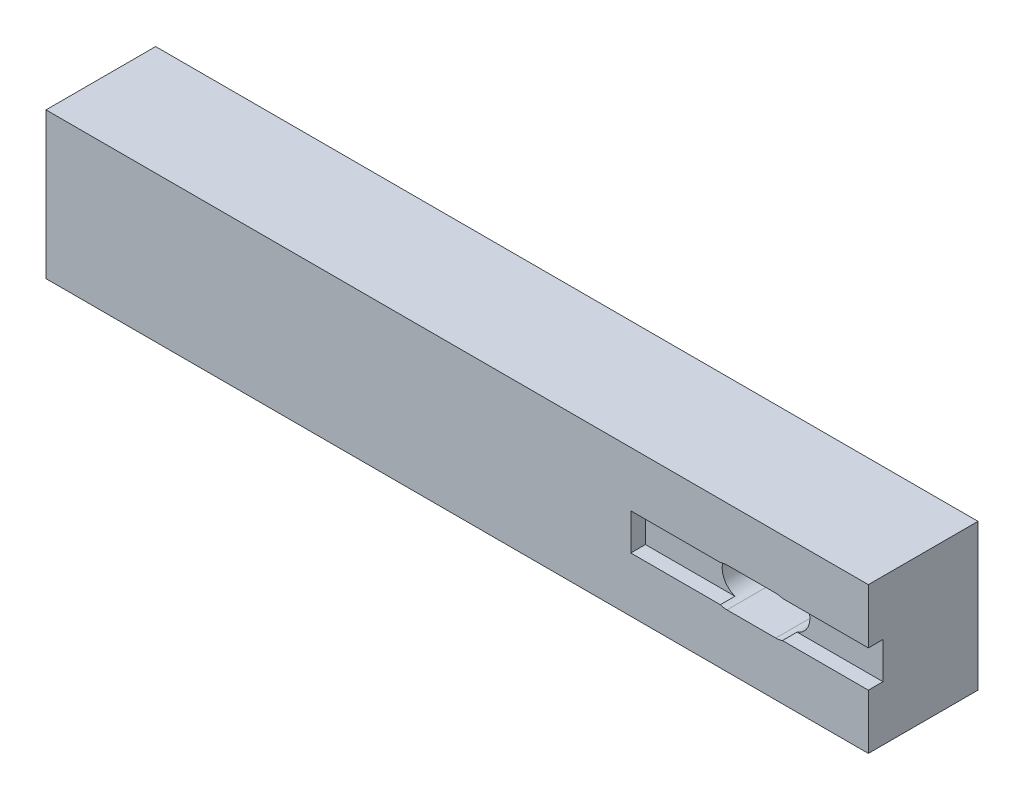
ISO-10303-21;
HEADER;
FILE_DESCRIPTION(('STEP AP214'),'2;1');
FILE_NAME('part.step','',(''),(''),'','','');
FILE_SCHEMA(('AUTOMOTIVE_DESIGN { 1 0 10303 214 1 1 1 1 }'));
ENDSEC;
DATA;
#1=APPLICATION_CONTEXT('core data for automotive mechanical design processes');
#2=APPLICATION_PROTOCOL_DEFINITION('international standard','automotive_design',2000,#1);
#3=PRODUCT_CONTEXT('',#1,'mechanical');
#4=PRODUCT('Part','Part','',(#3));
#5=PRODUCT_RELATED_PRODUCT_CATEGORY('part','',(#4));
#6=PRODUCT_DEFINITION_FORMATION('','',#4);
#7=PRODUCT_DEFINITION_CONTEXT('part definition',#1,'design');
#8=PRODUCT_DEFINITION('design','',#6,#7);
#9=PRODUCT_DEFINITION_SHAPE('','',#8);
#10=(LENGTH_UNIT() NAMED_UNIT(*) SI_UNIT(.MILLI.,.METRE.));
#11=(NAMED_UNIT(*) PLANE_ANGLE_UNIT() SI_UNIT($,.RADIAN.));
#12=(NAMED_UNIT(*) SI_UNIT($,.STERADIAN.) SOLID_ANGLE_UNIT());
#13=UNCERTAINTY_MEASURE_WITH_UNIT(LENGTH_MEASURE(1.E-05),#10,'distance_accuracy_value','');
#14=(GEOMETRIC_REPRESENTATION_CONTEXT(3) GLOBAL_UNCERTAINTY_ASSIGNED_CONTEXT((#13)) GLOBAL_UNIT_ASSIGNED_CONTEXT((#10,
#11,#12)) REPRESENTATION_CONTEXT('',''));
#15=CARTESIAN_POINT('',(0.,0.,0.));
#16=DIRECTION('',(0.,0.,1.));
#17=DIRECTION('',(1.,0.,0.));
#18=AXIS2_PLACEMENT_3D('',#15,#16,#17);
#19=CARTESIAN_POINT('',(82.5,0.,25.));
#20=DIRECTION('',(-1.,0.,0.));
#21=DIRECTION('',(0.,0.,1.));
#22=AXIS2_PLACEMENT_3D('',#19,#20,#21);
#23=PLANE('',#22);
#24=DIRECTION('',(0.,1.,0.));
#25=VECTOR('',#24,1.);
#26=CARTESIAN_POINT('',(82.5,0.,25.));
#27=LINE('',#26,#25);
#28=CARTESIAN_POINT('',(82.5,9.00000000000001,25.));
#29=VERTEX_POINT('',#28);
#30=CARTESIAN_POINT('',(82.5,16.5,25.));
#31=VERTEX_POINT('',#30);
#32=EDGE_CURVE('E288',#29,#31,#27,.T.);
#33=ORIENTED_EDGE('',*,*,#32,.F.);
#34=DIRECTION('',(0.,0.,1.));
#35=VECTOR('',#34,1.);
#36=CARTESIAN_POINT('',(82.5,9.00000000000001,23.));
#37=LINE('',#36,#35);
#38=CARTESIAN_POINT('',(82.5,9.00000000000001,23.));
#39=VERTEX_POINT('',#38);
#40=EDGE_CURVE('E220',#39,#29,#37,.T.);
#41=ORIENTED_EDGE('',*,*,#40,.F.);
#42=DIRECTION('',(0.,1.,0.));
#43=VECTOR('',#42,1.);
#44=CARTESIAN_POINT('',(82.5,9.00000000000001,23.));
#45=LINE('',#44,#43);
#46=CARTESIAN_POINT('',(82.5,4.,23.));
#47=VERTEX_POINT('',#46);
#48=EDGE_CURVE('E198',#47,#39,#45,.T.);
#49=ORIENTED_EDGE('',*,*,#48,.F.);
#50=DIRECTION('',(0.,0.,1.));
#51=VECTOR('',#50,1.);
#52=CARTESIAN_POINT('',(82.5,4.,23.));
#53=LINE('',#52,#51);
#54=CARTESIAN_POINT('',(82.5,4.,25.));
#55=VERTEX_POINT('',#54);
#56=EDGE_CURVE('E223',#47,#55,#53,.T.);
#57=ORIENTED_EDGE('',*,*,#56,.T.);
#58=CARTESIAN_POINT('',(82.5,-3.5,25.));
#59=VERTEX_POINT('',#58);
#60=EDGE_CURVE('E284',#59,#55,#27,.T.);
#61=ORIENTED_EDGE('',*,*,#60,.F.);
#62=DIRECTION('',(0.,0.,1.));
#63=VECTOR('',#62,1.);
#64=CARTESIAN_POINT('',(82.5,-3.5,-18.2179021190449));
#65=LINE('',#64,#63);
#66=CARTESIAN_POINT('',(82.5,-3.5,10.));
#67=VERTEX_POINT('',#66);
#68=EDGE_CURVE('E161',#67,#59,#65,.T.);
#69=ORIENTED_EDGE('',*,*,#68,.F.);
#70=DIRECTION('',(0.,1.,0.));
#71=VECTOR('',#70,1.);
#72=CARTESIAN_POINT('',(82.5,0.,10.));
#73=LINE('',#72,#71);
#74=CARTESIAN_POINT('',(82.5,16.5,10.));
#75=VERTEX_POINT('',#74);
#76=EDGE_CURVE('E283',#67,#75,#73,.T.);
#77=ORIENTED_EDGE('',*,*,#76,.T.);
#78=DIRECTION('',(0.,0.,1.));
#79=VECTOR('',#78,1.);
#80=CARTESIAN_POINT('',(82.5,16.5,-18.2179021190449));
#81=LINE('',#80,#79);
#82=EDGE_CURVE('E166',#75,#31,#81,.T.);
#83=ORIENTED_EDGE('',*,*,#82,.T.);
#84=EDGE_LOOP('',(#33,#41,#49,#57,#61,#69,#77,#83));
#85=FACE_BOUND('',#84,.T.);
#86=ADVANCED_FACE('F39',(#85),#23,.F.);
#87=CARTESIAN_POINT('',(0.,0.,25.));
#88=DIRECTION('',(0.,0.,-1.));
#89=DIRECTION('',(-1.,0.,0.));
#90=AXIS2_PLACEMENT_3D('',#87,#88,#89);
#91=PLANE('',#90);
#92=DIRECTION('',(-1.,0.,0.));
#93=VECTOR('',#92,1.);
#94=CARTESIAN_POINT('',(54.5,16.5,25.));
#95=LINE('',#94,#93);
#96=CARTESIAN_POINT('',(-30.,16.5,25.));
#97=VERTEX_POINT('',#96);
#98=EDGE_CURVE('E172',#31,#97,#95,.T.);
#99=ORIENTED_EDGE('',*,*,#98,.T.);
#100=DIRECTION('',(0.,1.,0.));
#101=VECTOR('',#100,1.);
#102=CARTESIAN_POINT('',(-30.,-3.5,25.));
#103=LINE('',#102,#101);
#104=CARTESIAN_POINT('',(-30.,-3.5,25.));
#105=VERTEX_POINT('',#104);
#106=EDGE_CURVE('E169',#105,#97,#103,.T.);
#107=ORIENTED_EDGE('',*,*,#106,.F.);
#108=DIRECTION('',(1.,0.,0.));
#109=VECTOR('',#108,1.);
#110=CARTESIAN_POINT('',(54.5,-3.5,25.));
#111=LINE('',#110,#109);
#112=EDGE_CURVE('E154',#105,#59,#111,.T.);
#113=ORIENTED_EDGE('',*,*,#112,.T.);
#114=ORIENTED_EDGE('',*,*,#60,.T.);
#115=DIRECTION('',(1.,0.,0.));
#116=VECTOR('',#115,1.);
#117=CARTESIAN_POINT('',(50.,4.,25.));
#118=LINE('',#117,#116);
#119=CARTESIAN_POINT('',(70.7486253353281,4.,25.));
#120=VERTEX_POINT('',#119);
#121=EDGE_CURVE('E208',#120,#55,#118,.T.);
#122=ORIENTED_EDGE('',*,*,#121,.F.);
#123=CARTESIAN_POINT('',(69.84,6.5,25.));
#124=DIRECTION('',(0.,0.,1.));
#125=DIRECTION('',(1.,0.,0.));
#126=AXIS2_PLACEMENT_3D('',#123,#124,#125);
#127=CIRCLE('',#126,2.66);
#128=CARTESIAN_POINT('',(69.84,3.84,25.));
#129=VERTEX_POINT('',#128);
#130=EDGE_CURVE('E249',#129,#120,#127,.T.);
#131=ORIENTED_EDGE('',*,*,#130,.F.);
#132=DIRECTION('',(1.,0.,0.));
#133=VECTOR('',#132,1.);
#134=CARTESIAN_POINT('',(63.16,3.84,25.));
#135=LINE('',#134,#133);
#136=CARTESIAN_POINT('',(63.16,3.84,25.));
#137=VERTEX_POINT('',#136);
#138=EDGE_CURVE('E244',#137,#129,#135,.T.);
#139=ORIENTED_EDGE('',*,*,#138,.F.);
#140=CARTESIAN_POINT('',(63.16,6.5,25.));
#141=DIRECTION('',(0.,0.,1.));
#142=DIRECTION('',(1.,0.,0.));
#143=AXIS2_PLACEMENT_3D('',#140,#141,#142);
#144=CIRCLE('',#143,2.66);
#145=CARTESIAN_POINT('',(62.2513746646719,4.,25.));
#146=VERTEX_POINT('',#145);
#147=EDGE_CURVE('E239',#146,#137,#144,.T.);
#148=ORIENTED_EDGE('',*,*,#147,.F.);
#149=CARTESIAN_POINT('',(50.,4.,25.));
#150=VERTEX_POINT('',#149);
#151=EDGE_CURVE('E209',#150,#146,#118,.T.);
#152=ORIENTED_EDGE('',*,*,#151,.F.);
#153=DIRECTION('',(0.,-1.,0.));
#154=VECTOR('',#153,1.);
#155=CARTESIAN_POINT('',(50.,9.,25.));
#156=LINE('',#155,#154);
#157=CARTESIAN_POINT('',(50.,9.,25.));
#158=VERTEX_POINT('',#157);
#159=EDGE_CURVE('E190',#158,#150,#156,.T.);
#160=ORIENTED_EDGE('',*,*,#159,.F.);
#161=DIRECTION('',(-1.,0.,0.));
#162=VECTOR('',#161,1.);
#163=CARTESIAN_POINT('',(50.,9.,25.));
#164=LINE('',#163,#162);
#165=CARTESIAN_POINT('',(62.2513746646719,9.,25.));
#166=VERTEX_POINT('',#165);
#167=EDGE_CURVE('E212',#166,#158,#164,.T.);
#168=ORIENTED_EDGE('',*,*,#167,.F.);
#169=CARTESIAN_POINT('',(63.16,9.16,25.));
#170=VERTEX_POINT('',#169);
#171=EDGE_CURVE('E240',#170,#166,#144,.T.);
#172=ORIENTED_EDGE('',*,*,#171,.F.);
#173=DIRECTION('',(-1.,0.,0.));
#174=VECTOR('',#173,1.);
#175=CARTESIAN_POINT('',(63.16,9.16,25.));
#176=LINE('',#175,#174);
#177=CARTESIAN_POINT('',(69.84,9.16,25.));
#178=VERTEX_POINT('',#177);
#179=EDGE_CURVE('E253',#178,#170,#176,.T.);
#180=ORIENTED_EDGE('',*,*,#179,.F.);
#181=CARTESIAN_POINT('',(70.7486253353281,9.,25.));
#182=VERTEX_POINT('',#181);
#183=EDGE_CURVE('E248',#182,#178,#127,.T.);
#184=ORIENTED_EDGE('',*,*,#183,.F.);
#185=EDGE_CURVE('E195',#29,#182,#164,.T.);
#186=ORIENTED_EDGE('',*,*,#185,.F.);
#187=ORIENTED_EDGE('',*,*,#32,.T.);
#188=EDGE_LOOP('',(#99,#107,#113,#114,#122,#131,#139,#148,#152,#160,#168,#172,#180,#184,#186,#187));
#189=FACE_BOUND('',#188,.T.);
#190=ADVANCED_FACE('F170',(#189),#91,.F.);
#191=CARTESIAN_POINT('',(0.,0.,10.));
#192=DIRECTION('',(0.,0.,-1.));
#193=DIRECTION('',(-1.,0.,0.));
#194=AXIS2_PLACEMENT_3D('',#191,#192,#193);
#195=PLANE('',#194);
#196=DIRECTION('',(1.,0.,0.));
#197=VECTOR('',#196,1.);
#198=CARTESIAN_POINT('',(54.5,-3.5,10.));
#199=LINE('',#198,#197);
#200=CARTESIAN_POINT('',(-30.,-3.5,10.));
#201=VERTEX_POINT('',#200);
#202=EDGE_CURVE('E165',#201,#67,#199,.T.);
#203=ORIENTED_EDGE('',*,*,#202,.F.);
#204=DIRECTION('',(0.,-1.,0.));
#205=VECTOR('',#204,1.);
#206=CARTESIAN_POINT('',(-30.,16.5,10.));
#207=LINE('',#206,#205);
#208=CARTESIAN_POINT('',(-30.,16.5,10.));
#209=VERTEX_POINT('',#208);
#210=EDGE_CURVE('E182',#209,#201,#207,.T.);
#211=ORIENTED_EDGE('',*,*,#210,.F.);
#212=DIRECTION('',(-1.,0.,0.));
#213=VECTOR('',#212,1.);
#214=CARTESIAN_POINT('',(54.5,16.5,10.));
#215=LINE('',#214,#213);
#216=EDGE_CURVE('E273',#75,#209,#215,.T.);
#217=ORIENTED_EDGE('',*,*,#216,.F.);
#218=ORIENTED_EDGE('',*,*,#76,.F.);
#219=EDGE_LOOP('',(#203,#211,#217,#218));
#220=FACE_BOUND('',#219,.T.);
#221=CARTESIAN_POINT('',(63.16,6.5,10.));
#222=DIRECTION('',(0.,0.,-1.));
#223=DIRECTION('',(-1.,0.,0.));
#224=AXIS2_PLACEMENT_3D('',#221,#222,#223);
#225=CIRCLE('',#224,2.66);
#226=CARTESIAN_POINT('',(63.16,3.84,10.));
#227=VERTEX_POINT('',#226);
#228=CARTESIAN_POINT('',(63.16,9.16,10.));
#229=VERTEX_POINT('',#228);
#230=EDGE_CURVE('E300',#227,#229,#225,.T.);
#231=ORIENTED_EDGE('',*,*,#230,.F.);
#232=DIRECTION('',(-1.,0.,0.));
#233=VECTOR('',#232,1.);
#234=CARTESIAN_POINT('',(0.,3.84000000000002,10.));
#235=LINE('',#234,#233);
#236=CARTESIAN_POINT('',(69.84,3.84,10.));
#237=VERTEX_POINT('',#236);
#238=EDGE_CURVE('E287',#237,#227,#235,.T.);
#239=ORIENTED_EDGE('',*,*,#238,.F.);
#240=CARTESIAN_POINT('',(69.84,6.5,10.));
#241=DIRECTION('',(0.,0.,-1.));
#242=DIRECTION('',(-1.,0.,0.));
#243=AXIS2_PLACEMENT_3D('',#240,#241,#242);
#244=CIRCLE('',#243,2.66);
#245=CARTESIAN_POINT('',(69.84,9.16,10.));
#246=VERTEX_POINT('',#245);
#247=EDGE_CURVE('E293',#246,#237,#244,.T.);
#248=ORIENTED_EDGE('',*,*,#247,.F.);
#249=DIRECTION('',(1.,0.,0.));
#250=VECTOR('',#249,1.);
#251=CARTESIAN_POINT('',(0.,9.15999999999999,10.));
#252=LINE('',#251,#250);
#253=EDGE_CURVE('E297',#229,#246,#252,.T.);
#254=ORIENTED_EDGE('',*,*,#253,.F.);
#255=EDGE_LOOP('',(#231,#239,#248,#254));
#256=FACE_BOUND('',#255,.T.);
#257=ADVANCED_FACE('F334',(#220,#256),#195,.T.);
#258=CARTESIAN_POINT('',(54.5,-3.5,-18.2179021190449));
#259=DIRECTION('',(0.,-1.,0.));
#260=DIRECTION('',(0.,0.,-1.));
#261=AXIS2_PLACEMENT_3D('',#258,#259,#260);
#262=PLANE('',#261);
#263=ORIENTED_EDGE('',*,*,#112,.F.);
#264=DIRECTION('',(0.,0.,1.));
#265=VECTOR('',#264,1.);
#266=CARTESIAN_POINT('',(-30.,-3.5,10.));
#267=LINE('',#266,#265);
#268=EDGE_CURVE('E159',#201,#105,#267,.T.);
#269=ORIENTED_EDGE('',*,*,#268,.F.);
#270=ORIENTED_EDGE('',*,*,#202,.T.);
#271=ORIENTED_EDGE('',*,*,#68,.T.);
#272=EDGE_LOOP('',(#263,#269,#270,#271));
#273=FACE_BOUND('',#272,.T.);
#274=ADVANCED_FACE('F156',(#273),#262,.T.);
#275=CARTESIAN_POINT('',(54.5,16.5,-18.2179021190449));
#276=DIRECTION('',(0.,1.,0.));
#277=DIRECTION('',(0.,0.,1.));
#278=AXIS2_PLACEMENT_3D('',#275,#276,#277);
#279=PLANE('',#278);
#280=ORIENTED_EDGE('',*,*,#82,.F.);
#281=ORIENTED_EDGE('',*,*,#216,.T.);
#282=DIRECTION('',(0.,0.,-1.));
#283=VECTOR('',#282,1.);
#284=CARTESIAN_POINT('',(-30.,16.5,25.));
#285=LINE('',#284,#283);
#286=EDGE_CURVE('E177',#97,#209,#285,.T.);
#287=ORIENTED_EDGE('',*,*,#286,.F.);
#288=ORIENTED_EDGE('',*,*,#98,.F.);
#289=EDGE_LOOP('',(#280,#281,#287,#288));
#290=FACE_BOUND('',#289,.T.);
#291=ADVANCED_FACE('F332',(#290),#279,.T.);
#292=CARTESIAN_POINT('',(63.16,6.5,0.));
#293=DIRECTION('',(0.,0.,1.));
#294=DIRECTION('',(1.,0.,0.));
#295=AXIS2_PLACEMENT_3D('',#292,#293,#294);
#296=CYLINDRICAL_SURFACE('',#295,2.66);
#297=ORIENTED_EDGE('',*,*,#171,.T.);
#298=DIRECTION('',(0.,0.,1.));
#299=VECTOR('',#298,1.);
#300=CARTESIAN_POINT('',(62.2513746646719,9.,0.));
#301=LINE('',#300,#299);
#302=CARTESIAN_POINT('',(62.2513746646719,9.,23.));
#303=VERTEX_POINT('',#302);
#304=EDGE_CURVE('E235',#166,#303,#301,.F.);
#305=ORIENTED_EDGE('',*,*,#304,.T.);
#306=CARTESIAN_POINT('',(63.16,6.5,23.));
#307=DIRECTION('',(0.,0.,1.));
#308=DIRECTION('',(1.,0.,0.));
#309=AXIS2_PLACEMENT_3D('',#306,#307,#308);
#310=CIRCLE('',#309,2.66);
#311=CARTESIAN_POINT('',(62.2513746646719,4.,23.));
#312=VERTEX_POINT('',#311);
#313=EDGE_CURVE('E219',#312,#303,#310,.F.);
#314=ORIENTED_EDGE('',*,*,#313,.F.);
#315=DIRECTION('',(0.,0.,1.));
#316=VECTOR('',#315,1.);
#317=CARTESIAN_POINT('',(62.2513746646719,4.,0.));
#318=LINE('',#317,#316);
#319=EDGE_CURVE('E231',#312,#146,#318,.T.);
#320=ORIENTED_EDGE('',*,*,#319,.T.);
#321=ORIENTED_EDGE('',*,*,#147,.T.);
#322=DIRECTION('',(0.,0.,1.));
#323=VECTOR('',#322,1.);
#324=CARTESIAN_POINT('',(63.16,3.84,0.));
#325=LINE('',#324,#323);
#326=EDGE_CURVE('E257',#227,#137,#325,.T.);
#327=ORIENTED_EDGE('',*,*,#326,.F.);
#328=ORIENTED_EDGE('',*,*,#230,.T.);
#329=DIRECTION('',(0.,0.,1.));
#330=VECTOR('',#329,1.);
#331=CARTESIAN_POINT('',(63.16,9.16,0.));
#332=LINE('',#331,#330);
#333=EDGE_CURVE('E258',#229,#170,#332,.T.);
#334=ORIENTED_EDGE('',*,*,#333,.T.);
#335=EDGE_LOOP('',(#297,#305,#314,#320,#321,#327,#328,#334));
#336=FACE_BOUND('',#335,.T.);
#337=ADVANCED_FACE('F355',(#336),#296,.F.);
#338=CARTESIAN_POINT('',(63.16,9.16,0.));
#339=DIRECTION('',(0.,1.,0.));
#340=DIRECTION('',(-1.,0.,0.));
#341=AXIS2_PLACEMENT_3D('',#338,#339,#340);
#342=PLANE('',#341);
#343=ORIENTED_EDGE('',*,*,#253,.T.);
#344=DIRECTION('',(0.,0.,1.));
#345=VECTOR('',#344,1.);
#346=CARTESIAN_POINT('',(69.84,9.16,0.));
#347=LINE('',#346,#345);
#348=EDGE_CURVE('E261',#246,#178,#347,.T.);
#349=ORIENTED_EDGE('',*,*,#348,.T.);
#350=ORIENTED_EDGE('',*,*,#179,.T.);
#351=ORIENTED_EDGE('',*,*,#333,.F.);
#352=EDGE_LOOP('',(#343,#349,#350,#351));
#353=FACE_BOUND('',#352,.T.);
#354=ADVANCED_FACE('F346',(#353),#342,.F.);
#355=CARTESIAN_POINT('',(69.84,6.5,0.));
#356=DIRECTION('',(0.,0.,1.));
#357=DIRECTION('',(1.,0.,0.));
#358=AXIS2_PLACEMENT_3D('',#355,#356,#357);
#359=CYLINDRICAL_SURFACE('',#358,2.66);
#360=CARTESIAN_POINT('',(69.84,6.5,23.));
#361=DIRECTION('',(0.,0.,1.));
#362=DIRECTION('',(1.,0.,0.));
#363=AXIS2_PLACEMENT_3D('',#360,#361,#362);
#364=CIRCLE('',#363,2.66);
#365=CARTESIAN_POINT('',(70.7486253353281,9.,23.));
#366=VERTEX_POINT('',#365);
#367=CARTESIAN_POINT('',(70.7486253353281,4.,23.));
#368=VERTEX_POINT('',#367);
#369=EDGE_CURVE('E303',#366,#368,#364,.F.);
#370=ORIENTED_EDGE('',*,*,#369,.F.);
#371=DIRECTION('',(0.,0.,1.));
#372=VECTOR('',#371,1.);
#373=CARTESIAN_POINT('',(70.7486253353281,9.,0.));
#374=LINE('',#373,#372);
#375=EDGE_CURVE('E11',#366,#182,#374,.T.);
#376=ORIENTED_EDGE('',*,*,#375,.T.);
#377=ORIENTED_EDGE('',*,*,#183,.T.);
#378=ORIENTED_EDGE('',*,*,#348,.F.);
#379=ORIENTED_EDGE('',*,*,#247,.T.);
#380=DIRECTION('',(0.,0.,1.));
#381=VECTOR('',#380,1.);
#382=CARTESIAN_POINT('',(69.84,3.84,0.));
#383=LINE('',#382,#381);
#384=EDGE_CURVE('E265',#237,#129,#383,.T.);
#385=ORIENTED_EDGE('',*,*,#384,.T.);
#386=ORIENTED_EDGE('',*,*,#130,.T.);
#387=DIRECTION('',(0.,0.,1.));
#388=VECTOR('',#387,1.);
#389=CARTESIAN_POINT('',(70.7486253353281,4.,0.));
#390=LINE('',#389,#388);
#391=EDGE_CURVE('E47',#120,#368,#390,.F.);
#392=ORIENTED_EDGE('',*,*,#391,.T.);
#393=EDGE_LOOP('',(#370,#376,#377,#378,#379,#385,#386,#392));
#394=FACE_BOUND('',#393,.T.);
#395=ADVANCED_FACE('F309',(#394),#359,.F.);
#396=CARTESIAN_POINT('',(63.16,3.84,0.));
#397=DIRECTION('',(0.,-1.,0.));
#398=DIRECTION('',(1.,0.,0.));
#399=AXIS2_PLACEMENT_3D('',#396,#397,#398);
#400=PLANE('',#399);
#401=ORIENTED_EDGE('',*,*,#238,.T.);
#402=ORIENTED_EDGE('',*,*,#326,.T.);
#403=ORIENTED_EDGE('',*,*,#138,.T.);
#404=ORIENTED_EDGE('',*,*,#384,.F.);
#405=EDGE_LOOP('',(#401,#402,#403,#404));
#406=FACE_BOUND('',#405,.T.);
#407=ADVANCED_FACE('F353',(#406),#400,.F.);
#408=CARTESIAN_POINT('',(0.,0.,23.));
#409=DIRECTION('',(0.,0.,1.));
#410=DIRECTION('',(1.,0.,0.));
#411=AXIS2_PLACEMENT_3D('',#408,#409,#410);
#412=PLANE('',#411);
#413=ORIENTED_EDGE('',*,*,#369,.T.);
#414=DIRECTION('',(1.,0.,0.));
#415=VECTOR('',#414,1.);
#416=CARTESIAN_POINT('',(50.,4.,23.));
#417=LINE('',#416,#415);
#418=EDGE_CURVE('E194',#368,#47,#417,.T.);
#419=ORIENTED_EDGE('',*,*,#418,.T.);
#420=ORIENTED_EDGE('',*,*,#48,.T.);
#421=DIRECTION('',(-1.,0.,0.));
#422=VECTOR('',#421,1.);
#423=CARTESIAN_POINT('',(50.,9.,23.));
#424=LINE('',#423,#422);
#425=EDGE_CURVE('E62',#39,#366,#424,.T.);
#426=ORIENTED_EDGE('',*,*,#425,.T.);
#427=EDGE_LOOP('',(#413,#419,#420,#426));
#428=FACE_BOUND('',#427,.T.);
#429=ADVANCED_FACE('F337',(#428),#412,.T.);
#430=CARTESIAN_POINT('',(50.,4.,23.));
#431=DIRECTION('',(0.,-1.,0.));
#432=DIRECTION('',(1.,0.,0.));
#433=AXIS2_PLACEMENT_3D('',#430,#431,#432);
#434=PLANE('',#433);
#435=ORIENTED_EDGE('',*,*,#121,.T.);
#436=ORIENTED_EDGE('',*,*,#56,.F.);
#437=ORIENTED_EDGE('',*,*,#418,.F.);
#438=ORIENTED_EDGE('',*,*,#391,.F.);
#439=EDGE_LOOP('',(#435,#436,#437,#438));
#440=FACE_BOUND('',#439,.T.);
#441=ADVANCED_FACE('F314',(#440),#434,.F.);
#442=CARTESIAN_POINT('',(50.,9.,23.));
#443=DIRECTION('',(0.,1.,0.));
#444=DIRECTION('',(-1.,0.,0.));
#445=AXIS2_PLACEMENT_3D('',#442,#443,#444);
#446=PLANE('',#445);
#447=ORIENTED_EDGE('',*,*,#425,.F.);
#448=ORIENTED_EDGE('',*,*,#40,.T.);
#449=ORIENTED_EDGE('',*,*,#185,.T.);
#450=ORIENTED_EDGE('',*,*,#375,.F.);
#451=EDGE_LOOP('',(#447,#448,#449,#450));
#452=FACE_BOUND('',#451,.T.);
#453=ADVANCED_FACE('F339',(#452),#446,.F.);
#454=ORIENTED_EDGE('',*,*,#167,.T.);
#455=DIRECTION('',(0.,0.,1.));
#456=VECTOR('',#455,1.);
#457=CARTESIAN_POINT('',(50.,9.,23.));
#458=LINE('',#457,#456);
#459=CARTESIAN_POINT('',(50.,9.,23.));
#460=VERTEX_POINT('',#459);
#461=EDGE_CURVE('E215',#460,#158,#458,.T.);
#462=ORIENTED_EDGE('',*,*,#461,.F.);
#463=EDGE_CURVE('E201',#303,#460,#424,.T.);
#464=ORIENTED_EDGE('',*,*,#463,.F.);
#465=ORIENTED_EDGE('',*,*,#304,.F.);
#466=EDGE_LOOP('',(#454,#462,#464,#465));
#467=FACE_BOUND('',#466,.T.);
#468=ADVANCED_FACE('F368',(#467),#446,.F.);
#469=CARTESIAN_POINT('',(50.,4.,23.));
#470=VERTEX_POINT('',#469);
#471=EDGE_CURVE('E54',#470,#312,#417,.T.);
#472=ORIENTED_EDGE('',*,*,#471,.F.);
#473=DIRECTION('',(0.,0.,1.));
#474=VECTOR('',#473,1.);
#475=CARTESIAN_POINT('',(50.,4.,23.));
#476=LINE('',#475,#474);
#477=EDGE_CURVE('E204',#470,#150,#476,.T.);
#478=ORIENTED_EDGE('',*,*,#477,.T.);
#479=ORIENTED_EDGE('',*,*,#151,.T.);
#480=ORIENTED_EDGE('',*,*,#319,.F.);
#481=EDGE_LOOP('',(#472,#478,#479,#480));
#482=FACE_BOUND('',#481,.T.);
#483=ADVANCED_FACE('F361',(#482),#434,.F.);
#484=ORIENTED_EDGE('',*,*,#313,.T.);
#485=ORIENTED_EDGE('',*,*,#463,.T.);
#486=DIRECTION('',(0.,-1.,0.));
#487=VECTOR('',#486,1.);
#488=CARTESIAN_POINT('',(50.,9.,23.));
#489=LINE('',#488,#487);
#490=EDGE_CURVE('E191',#460,#470,#489,.T.);
#491=ORIENTED_EDGE('',*,*,#490,.T.);
#492=ORIENTED_EDGE('',*,*,#471,.T.);
#493=EDGE_LOOP('',(#484,#485,#491,#492));
#494=FACE_BOUND('',#493,.T.);
#495=ADVANCED_FACE('F369',(#494),#412,.T.);
#496=CARTESIAN_POINT('',(50.,9.,23.));
#497=DIRECTION('',(-1.,0.,0.));
#498=DIRECTION('',(0.,-1.,0.));
#499=AXIS2_PLACEMENT_3D('',#496,#497,#498);
#500=PLANE('',#499);
#501=ORIENTED_EDGE('',*,*,#159,.T.);
#502=ORIENTED_EDGE('',*,*,#477,.F.);
#503=ORIENTED_EDGE('',*,*,#490,.F.);
#504=ORIENTED_EDGE('',*,*,#461,.T.);
#505=EDGE_LOOP('',(#501,#502,#503,#504));
#506=FACE_BOUND('',#505,.T.);
#507=ADVANCED_FACE('F364',(#506),#500,.F.);
#508=CARTESIAN_POINT('',(-30.,0.,0.));
#509=DIRECTION('',(-1.,0.,0.));
#510=DIRECTION('',(0.,0.,1.));
#511=AXIS2_PLACEMENT_3D('',#508,#509,#510);
#512=PLANE('',#511);
#513=ORIENTED_EDGE('',*,*,#268,.T.);
#514=ORIENTED_EDGE('',*,*,#106,.T.);
#515=ORIENTED_EDGE('',*,*,#286,.T.);
#516=ORIENTED_EDGE('',*,*,#210,.T.);
#517=EDGE_LOOP('',(#513,#514,#515,#516));
#518=FACE_BOUND('',#517,.T.);
#519=ADVANCED_FACE('F180',(#518),#512,.T.);
#520=CLOSED_SHELL('',(#86,#190,#257,#274,#291,#337,#354,#395,#407,#429,#441,#453,#468,#483,#495,
#507,#519));
#521=MANIFOLD_SOLID_BREP('B2',#520);
#522=ADVANCED_BREP_SHAPE_REPRESENTATION('',(#18,#521),#14);
#523=SHAPE_DEFINITION_REPRESENTATION(#9,#522);
ENDSEC;
END-ISO-10303-21;
